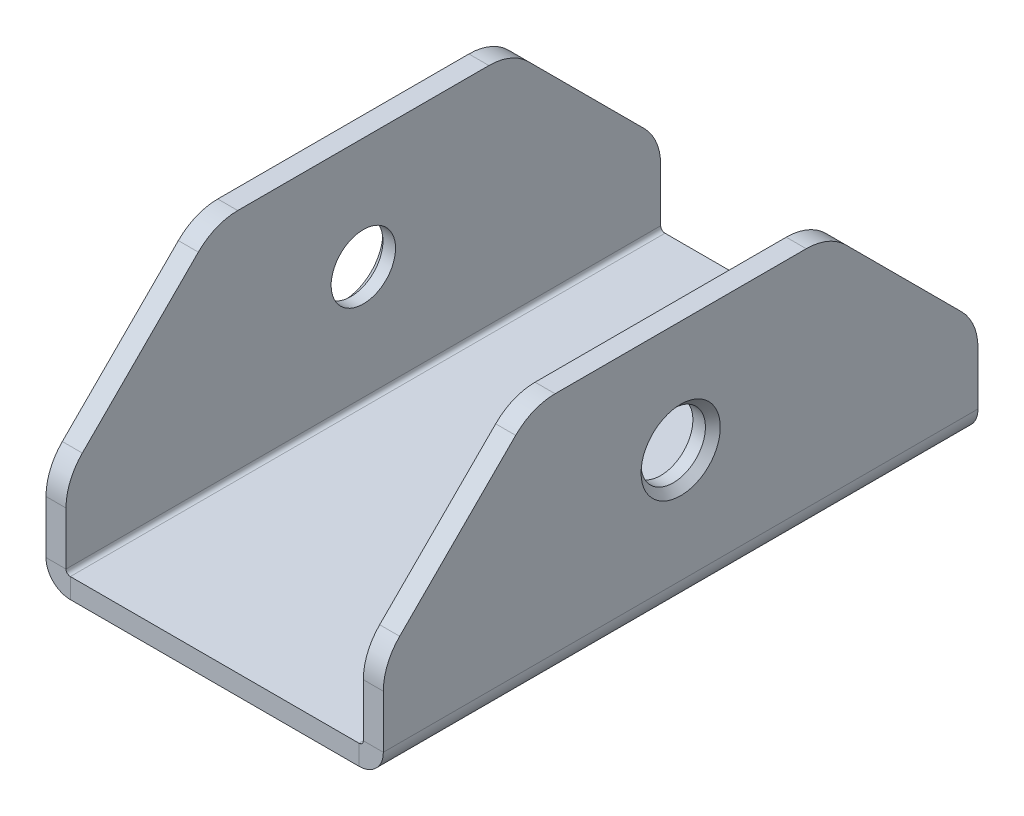
ISO-10303-21;
HEADER;
FILE_DESCRIPTION(('STEP AP214'),'2;1');
FILE_NAME('part.step','',(''),(''),'','','');
FILE_SCHEMA(('AUTOMOTIVE_DESIGN { 1 0 10303 214 1 1 1 1 }'));
ENDSEC;
DATA;
#1=APPLICATION_CONTEXT('core data for automotive mechanical design processes');
#2=APPLICATION_PROTOCOL_DEFINITION('international standard','automotive_design',2000,#1);
#3=PRODUCT_CONTEXT('',#1,'mechanical');
#4=PRODUCT('Part','Part','',(#3));
#5=PRODUCT_RELATED_PRODUCT_CATEGORY('part','',(#4));
#6=PRODUCT_DEFINITION_FORMATION('','',#4);
#7=PRODUCT_DEFINITION_CONTEXT('part definition',#1,'design');
#8=PRODUCT_DEFINITION('design','',#6,#7);
#9=PRODUCT_DEFINITION_SHAPE('','',#8);
#10=(LENGTH_UNIT() NAMED_UNIT(*) SI_UNIT(.MILLI.,.METRE.));
#11=(NAMED_UNIT(*) PLANE_ANGLE_UNIT() SI_UNIT($,.RADIAN.));
#12=(NAMED_UNIT(*) SI_UNIT($,.STERADIAN.) SOLID_ANGLE_UNIT());
#13=UNCERTAINTY_MEASURE_WITH_UNIT(LENGTH_MEASURE(1.E-05),#10,'distance_accuracy_value','');
#14=(GEOMETRIC_REPRESENTATION_CONTEXT(3) GLOBAL_UNCERTAINTY_ASSIGNED_CONTEXT((#13)) GLOBAL_UNIT_ASSIGNED_CONTEXT((#10,
#11,#12)) REPRESENTATION_CONTEXT('',''));
#15=CARTESIAN_POINT('',(0.,0.,0.));
#16=DIRECTION('',(0.,0.,1.));
#17=DIRECTION('',(1.,0.,0.));
#18=AXIS2_PLACEMENT_3D('',#15,#16,#17);
#19=CARTESIAN_POINT('',(0.7366,0.,101.6));
#20=DIRECTION('',(0.,0.,1.));
#21=DIRECTION('',(1.,0.,0.));
#22=AXIS2_PLACEMENT_3D('',#19,#20,#21);
#23=PLANE('',#22);
#24=DIRECTION('',(0.,-1.,0.));
#25=VECTOR('',#24,1.);
#26=CARTESIAN_POINT('',(0.7366,0.,101.6));
#27=LINE('',#26,#25);
#28=CARTESIAN_POINT('',(0.7366,0.,101.6));
#29=VERTEX_POINT('',#28);
#30=CARTESIAN_POINT('',(0.7366,-3.4163,101.6));
#31=VERTEX_POINT('',#30);
#32=EDGE_CURVE('E370',#29,#31,#27,.T.);
#33=ORIENTED_EDGE('',*,*,#32,.F.);
#34=CARTESIAN_POINT('',(0.7366,0.736599999999998,101.6));
#35=DIRECTION('',(0.,0.,-1.));
#36=DIRECTION('',(-1.,0.,0.));
#37=AXIS2_PLACEMENT_3D('',#34,#35,#36);
#38=CIRCLE('',#37,0.7366);
#39=CARTESIAN_POINT('',(0.,0.736599999999997,101.6));
#40=VERTEX_POINT('',#39);
#41=EDGE_CURVE('E252',#40,#29,#38,.F.);
#42=ORIENTED_EDGE('',*,*,#41,.F.);
#43=DIRECTION('',(1.,0.,0.));
#44=VECTOR('',#43,1.);
#45=CARTESIAN_POINT('',(-3.4163,0.736599999999992,101.6));
#46=LINE('',#45,#44);
#47=CARTESIAN_POINT('',(-3.4163,0.736599999999992,101.6));
#48=VERTEX_POINT('',#47);
#49=EDGE_CURVE('E366',#48,#40,#46,.T.);
#50=ORIENTED_EDGE('',*,*,#49,.F.);
#51=CARTESIAN_POINT('',(0.7366,0.736599999999998,101.6));
#52=DIRECTION('',(0.,0.,1.));
#53=DIRECTION('',(1.,0.,0.));
#54=AXIS2_PLACEMENT_3D('',#51,#52,#53);
#55=CIRCLE('',#54,4.1529);
#56=EDGE_CURVE('E265',#48,#31,#55,.T.);
#57=ORIENTED_EDGE('',*,*,#56,.T.);
#58=EDGE_LOOP('',(#33,#42,#50,#57));
#59=FACE_BOUND('',#58,.T.);
#60=ADVANCED_FACE('F43',(#59),#23,.T.);
#61=CARTESIAN_POINT('',(-3.4163,0.736599999999992,101.6));
#62=DIRECTION('',(0.,0.,1.));
#63=DIRECTION('',(1.,0.,0.));
#64=AXIS2_PLACEMENT_3D('',#61,#62,#63);
#65=PLANE('',#64);
#66=DIRECTION('',(1.,0.,0.));
#67=VECTOR('',#66,1.);
#68=CARTESIAN_POINT('',(0.,0.,101.6));
#69=LINE('',#68,#67);
#70=CARTESIAN_POINT('',(50.0634,0.,101.6));
#71=VERTEX_POINT('',#70);
#72=EDGE_CURVE('E249',#29,#71,#69,.T.);
#73=ORIENTED_EDGE('',*,*,#72,.F.);
#74=ORIENTED_EDGE('',*,*,#32,.T.);
#75=DIRECTION('',(1.,0.,0.));
#76=VECTOR('',#75,1.);
#77=CARTESIAN_POINT('',(0.,-3.4163,101.6));
#78=LINE('',#77,#76);
#79=CARTESIAN_POINT('',(50.0634,-3.4163,101.6));
#80=VERTEX_POINT('',#79);
#81=EDGE_CURVE('E269',#31,#80,#78,.T.);
#82=ORIENTED_EDGE('',*,*,#81,.T.);
#83=DIRECTION('',(0.,1.,0.));
#84=VECTOR('',#83,1.);
#85=CARTESIAN_POINT('',(50.0634,-3.4163,101.6));
#86=LINE('',#85,#84);
#87=EDGE_CURVE('E221',#80,#71,#86,.T.);
#88=ORIENTED_EDGE('',*,*,#87,.T.);
#89=EDGE_LOOP('',(#73,#74,#82,#88));
#90=FACE_BOUND('',#89,.T.);
#91=ADVANCED_FACE('F530',(#90),#65,.T.);
#92=CARTESIAN_POINT('',(0.,0.736599999999997,0.));
#93=DIRECTION('',(0.,0.,-1.));
#94=DIRECTION('',(-1.,0.,0.));
#95=AXIS2_PLACEMENT_3D('',#92,#93,#94);
#96=PLANE('',#95);
#97=DIRECTION('',(-1.,0.,0.));
#98=VECTOR('',#97,1.);
#99=CARTESIAN_POINT('',(0.,0.736599999999997,0.));
#100=LINE('',#99,#98);
#101=CARTESIAN_POINT('',(0.,0.736599999999997,0.));
#102=VERTEX_POINT('',#101);
#103=CARTESIAN_POINT('',(-3.4163,0.736599999999992,0.));
#104=VERTEX_POINT('',#103);
#105=EDGE_CURVE('E362',#102,#104,#100,.T.);
#106=ORIENTED_EDGE('',*,*,#105,.F.);
#107=CARTESIAN_POINT('',(0.7366,0.736599999999998,0.));
#108=DIRECTION('',(0.,0.,-1.));
#109=DIRECTION('',(-1.,0.,0.));
#110=AXIS2_PLACEMENT_3D('',#107,#108,#109);
#111=CIRCLE('',#110,0.7366);
#112=CARTESIAN_POINT('',(0.7366,0.,0.));
#113=VERTEX_POINT('',#112);
#114=EDGE_CURVE('E290',#102,#113,#111,.F.);
#115=ORIENTED_EDGE('',*,*,#114,.T.);
#116=DIRECTION('',(0.,1.,0.));
#117=VECTOR('',#116,1.);
#118=CARTESIAN_POINT('',(0.7366,-3.4163,0.));
#119=LINE('',#118,#117);
#120=CARTESIAN_POINT('',(0.7366,-3.4163,0.));
#121=VERTEX_POINT('',#120);
#122=EDGE_CURVE('E220',#121,#113,#119,.T.);
#123=ORIENTED_EDGE('',*,*,#122,.F.);
#124=CARTESIAN_POINT('',(0.7366,0.736599999999998,0.));
#125=DIRECTION('',(0.,0.,1.));
#126=DIRECTION('',(1.,0.,0.));
#127=AXIS2_PLACEMENT_3D('',#124,#125,#126);
#128=CIRCLE('',#127,4.1529);
#129=EDGE_CURVE('E300',#104,#121,#128,.T.);
#130=ORIENTED_EDGE('',*,*,#129,.F.);
#131=EDGE_LOOP('',(#106,#115,#123,#130));
#132=FACE_BOUND('',#131,.T.);
#133=ADVANCED_FACE('F536',(#132),#96,.T.);
#134=CARTESIAN_POINT('',(0.7366,-3.4163,0.));
#135=DIRECTION('',(0.,0.,-1.));
#136=DIRECTION('',(-1.,0.,0.));
#137=AXIS2_PLACEMENT_3D('',#134,#135,#136);
#138=PLANE('',#137);
#139=DIRECTION('',(0.,-1.,0.));
#140=VECTOR('',#139,1.);
#141=CARTESIAN_POINT('',(-3.4163,39.116,0.));
#142=LINE('',#141,#140);
#143=CARTESIAN_POINT('',(-3.4163,9.77061581839628,0.));
#144=VERTEX_POINT('',#143);
#145=EDGE_CURVE('E297',#144,#104,#142,.T.);
#146=ORIENTED_EDGE('',*,*,#145,.F.);
#147=DIRECTION('',(-1.,0.,0.));
#148=VECTOR('',#147,1.);
#149=CARTESIAN_POINT('',(0.7366,9.77061581839628,0.));
#150=LINE('',#149,#148);
#151=CARTESIAN_POINT('',(0.,9.77061581839628,0.));
#152=VERTEX_POINT('',#151);
#153=EDGE_CURVE('E447',#144,#152,#150,.F.);
#154=ORIENTED_EDGE('',*,*,#153,.T.);
#155=DIRECTION('',(0.,-1.,0.));
#156=VECTOR('',#155,1.);
#157=CARTESIAN_POINT('',(0.,39.116,0.));
#158=LINE('',#157,#156);
#159=EDGE_CURVE('E294',#152,#102,#158,.T.);
#160=ORIENTED_EDGE('',*,*,#159,.T.);
#161=ORIENTED_EDGE('',*,*,#105,.T.);
#162=EDGE_LOOP('',(#146,#154,#160,#161));
#163=FACE_BOUND('',#162,.T.);
#164=ADVANCED_FACE('F683',(#163),#138,.T.);
#165=CARTESIAN_POINT('',(50.8,0.7366,101.6));
#166=DIRECTION('',(0.,0.,1.));
#167=DIRECTION('',(1.,0.,0.));
#168=AXIS2_PLACEMENT_3D('',#165,#166,#167);
#169=PLANE('',#168);
#170=DIRECTION('',(1.,0.,0.));
#171=VECTOR('',#170,1.);
#172=CARTESIAN_POINT('',(50.8,0.7366,101.6));
#173=LINE('',#172,#171);
#174=CARTESIAN_POINT('',(50.8,0.7366,101.6));
#175=VERTEX_POINT('',#174);
#176=CARTESIAN_POINT('',(54.2163,0.7366,101.6));
#177=VERTEX_POINT('',#176);
#178=EDGE_CURVE('E207',#175,#177,#173,.T.);
#179=ORIENTED_EDGE('',*,*,#178,.F.);
#180=CARTESIAN_POINT('',(50.0634,0.7366,101.6));
#181=DIRECTION('',(0.,0.,-1.));
#182=DIRECTION('',(-1.,0.,0.));
#183=AXIS2_PLACEMENT_3D('',#180,#181,#182);
#184=CIRCLE('',#183,0.7366);
#185=EDGE_CURVE('E211',#71,#175,#184,.F.);
#186=ORIENTED_EDGE('',*,*,#185,.F.);
#187=ORIENTED_EDGE('',*,*,#87,.F.);
#188=CARTESIAN_POINT('',(50.0634,0.7366,101.6));
#189=DIRECTION('',(0.,0.,1.));
#190=DIRECTION('',(1.,0.,0.));
#191=AXIS2_PLACEMENT_3D('',#188,#189,#190);
#192=CIRCLE('',#191,4.1529);
#193=EDGE_CURVE('E214',#80,#177,#192,.T.);
#194=ORIENTED_EDGE('',*,*,#193,.T.);
#195=EDGE_LOOP('',(#179,#186,#187,#194));
#196=FACE_BOUND('',#195,.T.);
#197=ADVANCED_FACE('F209',(#196),#169,.T.);
#198=CARTESIAN_POINT('',(50.0634,-3.4163,101.6));
#199=DIRECTION('',(0.,0.,1.));
#200=DIRECTION('',(1.,0.,0.));
#201=AXIS2_PLACEMENT_3D('',#198,#199,#200);
#202=PLANE('',#201);
#203=DIRECTION('',(0.,1.,0.));
#204=VECTOR('',#203,1.);
#205=CARTESIAN_POINT('',(54.2163,0.,101.6));
#206=LINE('',#205,#204);
#207=CARTESIAN_POINT('',(54.2163,9.77061581839617,101.6));
#208=VERTEX_POINT('',#207);
#209=EDGE_CURVE('E243',#177,#208,#206,.T.);
#210=ORIENTED_EDGE('',*,*,#209,.T.);
#211=DIRECTION('',(1.,0.,0.));
#212=VECTOR('',#211,1.);
#213=CARTESIAN_POINT('',(50.0634,9.77061581839617,101.6));
#214=LINE('',#213,#212);
#215=CARTESIAN_POINT('',(50.8,9.77061581839617,101.6));
#216=VERTEX_POINT('',#215);
#217=EDGE_CURVE('E241',#208,#216,#214,.F.);
#218=ORIENTED_EDGE('',*,*,#217,.T.);
#219=DIRECTION('',(0.,1.,0.));
#220=VECTOR('',#219,1.);
#221=CARTESIAN_POINT('',(50.8,0.,101.6));
#222=LINE('',#221,#220);
#223=EDGE_CURVE('E228',#175,#216,#222,.T.);
#224=ORIENTED_EDGE('',*,*,#223,.F.);
#225=ORIENTED_EDGE('',*,*,#178,.T.);
#226=EDGE_LOOP('',(#210,#218,#224,#225));
#227=FACE_BOUND('',#226,.T.);
#228=ADVANCED_FACE('F239',(#227),#202,.T.);
#229=CARTESIAN_POINT('',(50.0634,0.,0.));
#230=DIRECTION('',(0.,0.,-1.));
#231=DIRECTION('',(-1.,0.,0.));
#232=AXIS2_PLACEMENT_3D('',#229,#230,#231);
#233=PLANE('',#232);
#234=DIRECTION('',(0.,-1.,0.));
#235=VECTOR('',#234,1.);
#236=CARTESIAN_POINT('',(50.0634,0.,0.));
#237=LINE('',#236,#235);
#238=CARTESIAN_POINT('',(50.0634,0.,0.));
#239=VERTEX_POINT('',#238);
#240=CARTESIAN_POINT('',(50.0634,-3.4163,0.));
#241=VERTEX_POINT('',#240);
#242=EDGE_CURVE('E355',#239,#241,#237,.T.);
#243=ORIENTED_EDGE('',*,*,#242,.F.);
#244=CARTESIAN_POINT('',(50.0634,0.7366,0.));
#245=DIRECTION('',(0.,0.,-1.));
#246=DIRECTION('',(-1.,0.,0.));
#247=AXIS2_PLACEMENT_3D('',#244,#245,#246);
#248=CIRCLE('',#247,0.7366);
#249=CARTESIAN_POINT('',(50.8,0.7366,0.));
#250=VERTEX_POINT('',#249);
#251=EDGE_CURVE('E283',#239,#250,#248,.F.);
#252=ORIENTED_EDGE('',*,*,#251,.T.);
#253=DIRECTION('',(-1.,0.,0.));
#254=VECTOR('',#253,1.);
#255=CARTESIAN_POINT('',(54.2163,0.7366,0.));
#256=LINE('',#255,#254);
#257=CARTESIAN_POINT('',(54.2163,0.7366,0.));
#258=VERTEX_POINT('',#257);
#259=EDGE_CURVE('E352',#258,#250,#256,.T.);
#260=ORIENTED_EDGE('',*,*,#259,.F.);
#261=CARTESIAN_POINT('',(50.0634,0.7366,0.));
#262=DIRECTION('',(0.,0.,1.));
#263=DIRECTION('',(1.,0.,0.));
#264=AXIS2_PLACEMENT_3D('',#261,#262,#263);
#265=CIRCLE('',#264,4.1529);
#266=EDGE_CURVE('E308',#241,#258,#265,.T.);
#267=ORIENTED_EDGE('',*,*,#266,.F.);
#268=EDGE_LOOP('',(#243,#252,#260,#267));
#269=FACE_BOUND('',#268,.T.);
#270=ADVANCED_FACE('F674',(#269),#233,.T.);
#271=CARTESIAN_POINT('',(54.2163,0.7366,0.));
#272=DIRECTION('',(0.,0.,-1.));
#273=DIRECTION('',(-1.,0.,0.));
#274=AXIS2_PLACEMENT_3D('',#271,#272,#273);
#275=PLANE('',#274);
#276=DIRECTION('',(1.,0.,0.));
#277=VECTOR('',#276,1.);
#278=CARTESIAN_POINT('',(0.,0.,0.));
#279=LINE('',#278,#277);
#280=EDGE_CURVE('E286',#113,#239,#279,.T.);
#281=ORIENTED_EDGE('',*,*,#280,.T.);
#282=ORIENTED_EDGE('',*,*,#242,.T.);
#283=DIRECTION('',(1.,0.,0.));
#284=VECTOR('',#283,1.);
#285=CARTESIAN_POINT('',(0.,-3.4163,0.));
#286=LINE('',#285,#284);
#287=EDGE_CURVE('E304',#121,#241,#286,.T.);
#288=ORIENTED_EDGE('',*,*,#287,.F.);
#289=ORIENTED_EDGE('',*,*,#122,.T.);
#290=EDGE_LOOP('',(#281,#282,#288,#289));
#291=FACE_BOUND('',#290,.T.);
#292=ADVANCED_FACE('F670',(#291),#275,.T.);
#293=CARTESIAN_POINT('',(54.2163,0.,101.6));
#294=DIRECTION('',(-1.,0.,0.));
#295=DIRECTION('',(0.,0.,1.));
#296=AXIS2_PLACEMENT_3D('',#293,#294,#295);
#297=PLANE('',#296);
#298=CARTESIAN_POINT('',(54.2163,20.066,50.8));
#299=DIRECTION('',(-1.,0.,0.));
#300=DIRECTION('',(0.,0.,1.));
#301=AXIS2_PLACEMENT_3D('',#298,#299,#300);
#302=CIRCLE('',#301,6.77000000000004);
#303=CARTESIAN_POINT('',(54.2163,20.066,57.57));
#304=VERTEX_POINT('',#303);
#305=EDGE_CURVE('E11',#304,#304,#302,.T.);
#306=ORIENTED_EDGE('',*,*,#305,.T.);
#307=EDGE_LOOP('',(#306));
#308=FACE_BOUND('',#307,.T.);
#309=DIRECTION('',(0.,1.,0.));
#310=VECTOR('',#309,1.);
#311=CARTESIAN_POINT('',(54.2163,0.,0.));
#312=LINE('',#311,#310);
#313=CARTESIAN_POINT('',(54.2163,9.77061581839628,0.));
#314=VERTEX_POINT('',#313);
#315=EDGE_CURVE('E276',#258,#314,#312,.T.);
#316=ORIENTED_EDGE('',*,*,#315,.T.);
#317=CARTESIAN_POINT('',(54.2163,9.77061581839628,9.525));
#318=DIRECTION('',(-1.,0.,0.));
#319=DIRECTION('',(0.,0.,1.));
#320=AXIS2_PLACEMENT_3D('',#317,#318,#319);
#321=CIRCLE('',#320,9.525);
#322=CARTESIAN_POINT('',(54.2163,16.5058079091982,2.78980790919815));
#323=VERTEX_POINT('',#322);
#324=EDGE_CURVE('E464',#314,#323,#321,.F.);
#325=ORIENTED_EDGE('',*,*,#324,.T.);
#326=DIRECTION('',(0.,-0.707106781186546,-0.707106781186549));
#327=VECTOR('',#326,1.);
#328=CARTESIAN_POINT('',(54.2163,13.716,0.));
#329=LINE('',#328,#327);
#330=CARTESIAN_POINT('',(54.2163,36.3261920908019,22.6101920908019));
#331=VERTEX_POINT('',#330);
#332=EDGE_CURVE('E377',#323,#331,#329,.F.);
#333=ORIENTED_EDGE('',*,*,#332,.T.);
#334=CARTESIAN_POINT('',(54.2163,29.591,29.3453841816038));
#335=DIRECTION('',(-1.,0.,0.));
#336=DIRECTION('',(0.,0.,1.));
#337=AXIS2_PLACEMENT_3D('',#334,#335,#336);
#338=CIRCLE('',#337,9.525);
#339=CARTESIAN_POINT('',(54.2163,39.116,29.3453841816038));
#340=VERTEX_POINT('',#339);
#341=EDGE_CURVE('E461',#331,#340,#338,.F.);
#342=ORIENTED_EDGE('',*,*,#341,.T.);
#343=DIRECTION('',(0.,0.,-1.));
#344=VECTOR('',#343,1.);
#345=CARTESIAN_POINT('',(54.2163,39.116,101.6));
#346=LINE('',#345,#344);
#347=CARTESIAN_POINT('',(54.2163,39.116,72.2546158183962));
#348=VERTEX_POINT('',#347);
#349=EDGE_CURVE('E348',#348,#340,#346,.T.);
#350=ORIENTED_EDGE('',*,*,#349,.F.);
#351=CARTESIAN_POINT('',(54.2163,29.591,72.2546158183962));
#352=DIRECTION('',(-1.,0.,0.));
#353=DIRECTION('',(0.,0.,1.));
#354=AXIS2_PLACEMENT_3D('',#351,#352,#353);
#355=CIRCLE('',#354,9.525);
#356=CARTESIAN_POINT('',(54.2163,36.3261920908019,78.9898079091981));
#357=VERTEX_POINT('',#356);
#358=EDGE_CURVE('E458',#348,#357,#355,.F.);
#359=ORIENTED_EDGE('',*,*,#358,.T.);
#360=DIRECTION('',(0.,0.707106781186549,-0.707106781186546));
#361=VECTOR('',#360,1.);
#362=CARTESIAN_POINT('',(54.2163,39.116,76.2));
#363=LINE('',#362,#361);
#364=CARTESIAN_POINT('',(54.2163,16.505807909198,98.8101920908019));
#365=VERTEX_POINT('',#364);
#366=EDGE_CURVE('E373',#357,#365,#363,.F.);
#367=ORIENTED_EDGE('',*,*,#366,.T.);
#368=CARTESIAN_POINT('',(54.2163,9.77061581839617,92.075));
#369=DIRECTION('',(-1.,0.,0.));
#370=DIRECTION('',(0.,0.,1.));
#371=AXIS2_PLACEMENT_3D('',#368,#369,#370);
#372=CIRCLE('',#371,9.525);
#373=EDGE_CURVE('E455',#365,#208,#372,.F.);
#374=ORIENTED_EDGE('',*,*,#373,.T.);
#375=ORIENTED_EDGE('',*,*,#209,.F.);
#376=DIRECTION('',(0.,0.,-1.));
#377=VECTOR('',#376,1.);
#378=CARTESIAN_POINT('',(54.2163,0.7366,101.6));
#379=LINE('',#378,#377);
#380=EDGE_CURVE('E275',#177,#258,#379,.T.);
#381=ORIENTED_EDGE('',*,*,#380,.T.);
#382=EDGE_LOOP('',(#316,#325,#333,#342,#350,#359,#367,#374,#375,#381));
#383=FACE_BOUND('',#382,.T.);
#384=ADVANCED_FACE('F648',(#308,#383),#297,.F.);
#385=CARTESIAN_POINT('',(50.8,39.116,101.6));
#386=DIRECTION('',(0.,1.,0.));
#387=DIRECTION('',(0.,0.,1.));
#388=AXIS2_PLACEMENT_3D('',#385,#386,#387);
#389=PLANE('',#388);
#390=ORIENTED_EDGE('',*,*,#349,.T.);
#391=DIRECTION('',(1.,0.,0.));
#392=VECTOR('',#391,1.);
#393=CARTESIAN_POINT('',(50.8,39.116,29.3453841816038));
#394=LINE('',#393,#392);
#395=CARTESIAN_POINT('',(50.8,39.116,29.3453841816038));
#396=VERTEX_POINT('',#395);
#397=EDGE_CURVE('E488',#340,#396,#394,.F.);
#398=ORIENTED_EDGE('',*,*,#397,.T.);
#399=DIRECTION('',(0.,0.,-1.));
#400=VECTOR('',#399,1.);
#401=CARTESIAN_POINT('',(50.8,39.116,101.6));
#402=LINE('',#401,#400);
#403=CARTESIAN_POINT('',(50.8,39.116,72.2546158183962));
#404=VERTEX_POINT('',#403);
#405=EDGE_CURVE('E235',#404,#396,#402,.T.);
#406=ORIENTED_EDGE('',*,*,#405,.F.);
#407=DIRECTION('',(-1.,0.,0.));
#408=VECTOR('',#407,1.);
#409=CARTESIAN_POINT('',(50.8,39.116,72.2546158183962));
#410=LINE('',#409,#408);
#411=EDGE_CURVE('E484',#404,#348,#410,.F.);
#412=ORIENTED_EDGE('',*,*,#411,.T.);
#413=EDGE_LOOP('',(#390,#398,#406,#412));
#414=FACE_BOUND('',#413,.T.);
#415=ADVANCED_FACE('F657',(#414),#389,.T.);
#416=CARTESIAN_POINT('',(50.8,0.,101.6));
#417=DIRECTION('',(-1.,0.,0.));
#418=DIRECTION('',(0.,0.,1.));
#419=AXIS2_PLACEMENT_3D('',#416,#417,#418);
#420=PLANE('',#419);
#421=CARTESIAN_POINT('',(50.8,20.066,50.8));
#422=DIRECTION('',(-1.,0.,0.));
#423=DIRECTION('',(0.,0.,1.));
#424=AXIS2_PLACEMENT_3D('',#421,#422,#423);
#425=CIRCLE('',#424,5.49999999999998);
#426=CARTESIAN_POINT('',(50.8,20.066,56.3));
#427=VERTEX_POINT('',#426);
#428=EDGE_CURVE('E280',#427,#427,#425,.T.);
#429=ORIENTED_EDGE('',*,*,#428,.F.);
#430=EDGE_LOOP('',(#429));
#431=FACE_BOUND('',#430,.T.);
#432=DIRECTION('',(0.,0.707106781186546,0.707106781186549));
#433=VECTOR('',#432,1.);
#434=CARTESIAN_POINT('',(50.8,57.658,43.9420000000002));
#435=LINE('',#434,#433);
#436=CARTESIAN_POINT('',(50.8,36.3261920908019,22.6101920908019));
#437=VERTEX_POINT('',#436);
#438=CARTESIAN_POINT('',(50.8,16.5058079091982,2.78980790919814));
#439=VERTEX_POINT('',#438);
#440=EDGE_CURVE('E384',#437,#439,#435,.F.);
#441=ORIENTED_EDGE('',*,*,#440,.T.);
#442=CARTESIAN_POINT('',(50.8,9.77061581839628,9.525));
#443=DIRECTION('',(-1.,0.,0.));
#444=DIRECTION('',(0.,0.,1.));
#445=AXIS2_PLACEMENT_3D('',#442,#443,#444);
#446=CIRCLE('',#445,9.525);
#447=CARTESIAN_POINT('',(50.8,9.77061581839628,0.));
#448=VERTEX_POINT('',#447);
#449=EDGE_CURVE('E481',#439,#448,#446,.T.);
#450=ORIENTED_EDGE('',*,*,#449,.T.);
#451=DIRECTION('',(0.,1.,0.));
#452=VECTOR('',#451,1.);
#453=CARTESIAN_POINT('',(50.8,0.,0.));
#454=LINE('',#453,#452);
#455=EDGE_CURVE('E230',#250,#448,#454,.T.);
#456=ORIENTED_EDGE('',*,*,#455,.F.);
#457=DIRECTION('',(0.,0.,-1.));
#458=VECTOR('',#457,1.);
#459=CARTESIAN_POINT('',(50.8,0.7366,101.6));
#460=LINE('',#459,#458);
#461=EDGE_CURVE('E225',#175,#250,#460,.T.);
#462=ORIENTED_EDGE('',*,*,#461,.F.);
#463=ORIENTED_EDGE('',*,*,#223,.T.);
#464=CARTESIAN_POINT('',(50.8,9.77061581839617,92.075));
#465=DIRECTION('',(-1.,0.,0.));
#466=DIRECTION('',(0.,0.,1.));
#467=AXIS2_PLACEMENT_3D('',#464,#465,#466);
#468=CIRCLE('',#467,9.525);
#469=CARTESIAN_POINT('',(50.8,16.505807909198,98.8101920908019));
#470=VERTEX_POINT('',#469);
#471=EDGE_CURVE('E67',#216,#470,#468,.T.);
#472=ORIENTED_EDGE('',*,*,#471,.T.);
#473=DIRECTION('',(0.,-0.707106781186549,0.707106781186546));
#474=VECTOR('',#473,1.);
#475=CARTESIAN_POINT('',(50.8,6.85799999999993,108.458));
#476=LINE('',#475,#474);
#477=CARTESIAN_POINT('',(50.8,36.3261920908019,78.9898079091981));
#478=VERTEX_POINT('',#477);
#479=EDGE_CURVE('E381',#470,#478,#476,.F.);
#480=ORIENTED_EDGE('',*,*,#479,.T.);
#481=CARTESIAN_POINT('',(50.8,29.591,72.2546158183962));
#482=DIRECTION('',(-1.,0.,0.));
#483=DIRECTION('',(0.,0.,1.));
#484=AXIS2_PLACEMENT_3D('',#481,#482,#483);
#485=CIRCLE('',#484,9.525);
#486=EDGE_CURVE('E475',#478,#404,#485,.T.);
#487=ORIENTED_EDGE('',*,*,#486,.T.);
#488=ORIENTED_EDGE('',*,*,#405,.T.);
#489=CARTESIAN_POINT('',(50.8,29.591,29.3453841816038));
#490=DIRECTION('',(-1.,0.,0.));
#491=DIRECTION('',(0.,0.,1.));
#492=AXIS2_PLACEMENT_3D('',#489,#490,#491);
#493=CIRCLE('',#492,9.525);
#494=EDGE_CURVE('E478',#396,#437,#493,.T.);
#495=ORIENTED_EDGE('',*,*,#494,.T.);
#496=EDGE_LOOP('',(#441,#450,#456,#462,#463,#472,#480,#487,#488,#495));
#497=FACE_BOUND('',#496,.T.);
#498=ADVANCED_FACE('F227',(#431,#497),#420,.T.);
#499=CARTESIAN_POINT('',(50.0634,0.7366,101.6));
#500=DIRECTION('',(0.,0.,-1.));
#501=DIRECTION('',(-1.,0.,0.));
#502=AXIS2_PLACEMENT_3D('',#499,#500,#501);
#503=CYLINDRICAL_SURFACE('',#502,0.7366);
#504=ORIENTED_EDGE('',*,*,#251,.F.);
#505=DIRECTION('',(0.,0.,-1.));
#506=VECTOR('',#505,1.);
#507=CARTESIAN_POINT('',(50.0634,0.,101.6));
#508=LINE('',#507,#506);
#509=EDGE_CURVE('E236',#71,#239,#508,.T.);
#510=ORIENTED_EDGE('',*,*,#509,.F.);
#511=ORIENTED_EDGE('',*,*,#185,.T.);
#512=ORIENTED_EDGE('',*,*,#461,.T.);
#513=EDGE_LOOP('',(#504,#510,#511,#512));
#514=FACE_BOUND('',#513,.T.);
#515=ADVANCED_FACE('F246',(#514),#503,.F.);
#516=CARTESIAN_POINT('',(0.,0.,101.6));
#517=DIRECTION('',(0.,1.,0.));
#518=DIRECTION('',(0.,0.,1.));
#519=AXIS2_PLACEMENT_3D('',#516,#517,#518);
#520=PLANE('',#519);
#521=ORIENTED_EDGE('',*,*,#280,.F.);
#522=DIRECTION('',(0.,0.,-1.));
#523=VECTOR('',#522,1.);
#524=CARTESIAN_POINT('',(0.7366,0.,101.6));
#525=LINE('',#524,#523);
#526=EDGE_CURVE('E339',#29,#113,#525,.T.);
#527=ORIENTED_EDGE('',*,*,#526,.F.);
#528=ORIENTED_EDGE('',*,*,#72,.T.);
#529=ORIENTED_EDGE('',*,*,#509,.T.);
#530=EDGE_LOOP('',(#521,#527,#528,#529));
#531=FACE_BOUND('',#530,.T.);
#532=ADVANCED_FACE('F636',(#531),#520,.T.);
#533=CARTESIAN_POINT('',(0.7366,0.736599999999998,101.6));
#534=DIRECTION('',(0.,0.,-1.));
#535=DIRECTION('',(-1.,0.,0.));
#536=AXIS2_PLACEMENT_3D('',#533,#534,#535);
#537=CYLINDRICAL_SURFACE('',#536,0.7366);
#538=ORIENTED_EDGE('',*,*,#114,.F.);
#539=DIRECTION('',(0.,0.,-1.));
#540=VECTOR('',#539,1.);
#541=CARTESIAN_POINT('',(0.,0.736599999999997,101.6));
#542=LINE('',#541,#540);
#543=EDGE_CURVE('E335',#40,#102,#542,.T.);
#544=ORIENTED_EDGE('',*,*,#543,.F.);
#545=ORIENTED_EDGE('',*,*,#41,.T.);
#546=ORIENTED_EDGE('',*,*,#526,.T.);
#547=EDGE_LOOP('',(#538,#544,#545,#546));
#548=FACE_BOUND('',#547,.T.);
#549=ADVANCED_FACE('F628',(#548),#537,.F.);
#550=CARTESIAN_POINT('',(0.,39.116,101.6));
#551=DIRECTION('',(1.,0.,0.));
#552=DIRECTION('',(0.,1.,0.));
#553=AXIS2_PLACEMENT_3D('',#550,#551,#552);
#554=PLANE('',#553);
#555=CARTESIAN_POINT('',(0.,20.066,50.8));
#556=DIRECTION('',(1.,0.,0.));
#557=DIRECTION('',(0.,1.,0.));
#558=AXIS2_PLACEMENT_3D('',#555,#556,#557);
#559=CIRCLE('',#558,5.49999999999998);
#560=CARTESIAN_POINT('',(0.,25.566,50.8));
#561=VERTEX_POINT('',#560);
#562=EDGE_CURVE('E504',#561,#561,#559,.T.);
#563=ORIENTED_EDGE('',*,*,#562,.F.);
#564=EDGE_LOOP('',(#563));
#565=FACE_BOUND('',#564,.T.);
#566=DIRECTION('',(0.,0.,-1.));
#567=VECTOR('',#566,1.);
#568=CARTESIAN_POINT('',(0.,39.116,101.6));
#569=LINE('',#568,#567);
#570=CARTESIAN_POINT('',(0.,39.116,72.2546158183962));
#571=VERTEX_POINT('',#570);
#572=CARTESIAN_POINT('',(0.,39.116,29.3453841816038));
#573=VERTEX_POINT('',#572);
#574=EDGE_CURVE('E331',#571,#573,#569,.T.);
#575=ORIENTED_EDGE('',*,*,#574,.F.);
#576=CARTESIAN_POINT('',(0.,29.591,72.2546158183962));
#577=DIRECTION('',(1.,0.,0.));
#578=DIRECTION('',(0.,1.,0.));
#579=AXIS2_PLACEMENT_3D('',#576,#577,#578);
#580=CIRCLE('',#579,9.525);
#581=CARTESIAN_POINT('',(0.,36.3261920908019,78.9898079091981));
#582=VERTEX_POINT('',#581);
#583=EDGE_CURVE('E420',#571,#582,#580,.T.);
#584=ORIENTED_EDGE('',*,*,#583,.T.);
#585=DIRECTION('',(0.,-0.707106781186549,0.707106781186546));
#586=VECTOR('',#585,1.);
#587=CARTESIAN_POINT('',(0.,26.416,88.8999999999999));
#588=LINE('',#587,#586);
#589=CARTESIAN_POINT('',(0.,16.505807909198,98.8101920908019));
#590=VERTEX_POINT('',#589);
#591=EDGE_CURVE('E387',#582,#590,#588,.T.);
#592=ORIENTED_EDGE('',*,*,#591,.T.);
#593=CARTESIAN_POINT('',(0.,9.77061581839618,92.075));
#594=DIRECTION('',(1.,0.,0.));
#595=DIRECTION('',(0.,1.,0.));
#596=AXIS2_PLACEMENT_3D('',#593,#594,#595);
#597=CIRCLE('',#596,9.525);
#598=CARTESIAN_POINT('',(0.,9.77061581839618,101.6));
#599=VERTEX_POINT('',#598);
#600=EDGE_CURVE('E411',#590,#599,#597,.T.);
#601=ORIENTED_EDGE('',*,*,#600,.T.);
#602=DIRECTION('',(0.,-1.,0.));
#603=VECTOR('',#602,1.);
#604=CARTESIAN_POINT('',(0.,39.116,101.6));
#605=LINE('',#604,#603);
#606=EDGE_CURVE('E259',#599,#40,#605,.T.);
#607=ORIENTED_EDGE('',*,*,#606,.T.);
#608=ORIENTED_EDGE('',*,*,#543,.T.);
#609=ORIENTED_EDGE('',*,*,#159,.F.);
#610=CARTESIAN_POINT('',(0.,9.77061581839628,9.525));
#611=DIRECTION('',(1.,0.,0.));
#612=DIRECTION('',(0.,1.,0.));
#613=AXIS2_PLACEMENT_3D('',#610,#611,#612);
#614=CIRCLE('',#613,9.525);
#615=CARTESIAN_POINT('',(0.,16.5058079091982,2.78980790919813));
#616=VERTEX_POINT('',#615);
#617=EDGE_CURVE('E414',#152,#616,#614,.T.);
#618=ORIENTED_EDGE('',*,*,#617,.T.);
#619=DIRECTION('',(0.,-0.707106781186546,-0.707106781186549));
#620=VECTOR('',#619,1.);
#621=CARTESIAN_POINT('',(0.,77.216,63.5000000000002));
#622=LINE('',#621,#620);
#623=CARTESIAN_POINT('',(0.,36.3261920908019,22.6101920908019));
#624=VERTEX_POINT('',#623);
#625=EDGE_CURVE('E391',#616,#624,#622,.F.);
#626=ORIENTED_EDGE('',*,*,#625,.T.);
#627=CARTESIAN_POINT('',(0.,29.591,29.3453841816038));
#628=DIRECTION('',(1.,0.,0.));
#629=DIRECTION('',(0.,1.,0.));
#630=AXIS2_PLACEMENT_3D('',#627,#628,#629);
#631=CIRCLE('',#630,9.525);
#632=EDGE_CURVE('E417',#624,#573,#631,.T.);
#633=ORIENTED_EDGE('',*,*,#632,.T.);
#634=EDGE_LOOP('',(#575,#584,#592,#601,#607,#608,#609,#618,#626,#633));
#635=FACE_BOUND('',#634,.T.);
#636=ADVANCED_FACE('F617',(#565,#635),#554,.T.);
#637=CARTESIAN_POINT('',(-3.4163,39.116,101.6));
#638=DIRECTION('',(0.,1.,0.));
#639=DIRECTION('',(0.,0.,1.));
#640=AXIS2_PLACEMENT_3D('',#637,#638,#639);
#641=PLANE('',#640);
#642=DIRECTION('',(0.,0.,-1.));
#643=VECTOR('',#642,1.);
#644=CARTESIAN_POINT('',(-3.4163,39.116,101.6));
#645=LINE('',#644,#643);
#646=CARTESIAN_POINT('',(-3.4163,39.116,72.2546158183962));
#647=VERTEX_POINT('',#646);
#648=CARTESIAN_POINT('',(-3.4163,39.116,29.3453841816038));
#649=VERTEX_POINT('',#648);
#650=EDGE_CURVE('E327',#647,#649,#645,.T.);
#651=ORIENTED_EDGE('',*,*,#650,.F.);
#652=DIRECTION('',(1.,0.,0.));
#653=VECTOR('',#652,1.);
#654=CARTESIAN_POINT('',(-3.4163,39.116,72.2546158183962));
#655=LINE('',#654,#653);
#656=EDGE_CURVE('E407',#647,#571,#655,.T.);
#657=ORIENTED_EDGE('',*,*,#656,.T.);
#658=ORIENTED_EDGE('',*,*,#574,.T.);
#659=DIRECTION('',(1.,0.,0.));
#660=VECTOR('',#659,1.);
#661=CARTESIAN_POINT('',(-3.4163,39.116,29.3453841816038));
#662=LINE('',#661,#660);
#663=EDGE_CURVE('E403',#573,#649,#662,.F.);
#664=ORIENTED_EDGE('',*,*,#663,.T.);
#665=EDGE_LOOP('',(#651,#657,#658,#664));
#666=FACE_BOUND('',#665,.T.);
#667=ADVANCED_FACE('F707',(#666),#641,.T.);
#668=CARTESIAN_POINT('',(-3.4163,39.116,101.6));
#669=DIRECTION('',(1.,0.,0.));
#670=DIRECTION('',(0.,1.,0.));
#671=AXIS2_PLACEMENT_3D('',#668,#669,#670);
#672=PLANE('',#671);
#673=CARTESIAN_POINT('',(-3.4163,20.066,50.8));
#674=DIRECTION('',(1.,0.,0.));
#675=DIRECTION('',(0.,1.,0.));
#676=AXIS2_PLACEMENT_3D('',#673,#674,#675);
#677=CIRCLE('',#676,6.77000000000002);
#678=CARTESIAN_POINT('',(-3.4163,26.836,50.8));
#679=VERTEX_POINT('',#678);
#680=EDGE_CURVE('E503',#679,#679,#677,.T.);
#681=ORIENTED_EDGE('',*,*,#680,.T.);
#682=EDGE_LOOP('',(#681));
#683=FACE_BOUND('',#682,.T.);
#684=DIRECTION('',(0.,0.707106781186549,-0.707106781186546));
#685=VECTOR('',#684,1.);
#686=CARTESIAN_POINT('',(-3.4163,39.116,76.2));
#687=LINE('',#686,#685);
#688=CARTESIAN_POINT('',(-3.4163,16.505807909198,98.8101920908019));
#689=VERTEX_POINT('',#688);
#690=CARTESIAN_POINT('',(-3.4163,36.3261920908019,78.9898079091981));
#691=VERTEX_POINT('',#690);
#692=EDGE_CURVE('E395',#689,#691,#687,.T.);
#693=ORIENTED_EDGE('',*,*,#692,.T.);
#694=CARTESIAN_POINT('',(-3.4163,29.591,72.2546158183962));
#695=DIRECTION('',(1.,0.,0.));
#696=DIRECTION('',(0.,1.,0.));
#697=AXIS2_PLACEMENT_3D('',#694,#695,#696);
#698=CIRCLE('',#697,9.525);
#699=EDGE_CURVE('E438',#691,#647,#698,.F.);
#700=ORIENTED_EDGE('',*,*,#699,.T.);
#701=ORIENTED_EDGE('',*,*,#650,.T.);
#702=CARTESIAN_POINT('',(-3.4163,29.591,29.3453841816038));
#703=DIRECTION('',(1.,0.,0.));
#704=DIRECTION('',(0.,1.,0.));
#705=AXIS2_PLACEMENT_3D('',#702,#703,#704);
#706=CIRCLE('',#705,9.525);
#707=CARTESIAN_POINT('',(-3.4163,36.3261920908019,22.6101920908019));
#708=VERTEX_POINT('',#707);
#709=EDGE_CURVE('E435',#649,#708,#706,.F.);
#710=ORIENTED_EDGE('',*,*,#709,.T.);
#711=DIRECTION('',(0.,0.707106781186546,0.707106781186549));
#712=VECTOR('',#711,1.);
#713=CARTESIAN_POINT('',(-3.4163,13.716,0.));
#714=LINE('',#713,#712);
#715=CARTESIAN_POINT('',(-3.4163,16.5058079091982,2.78980790919815));
#716=VERTEX_POINT('',#715);
#717=EDGE_CURVE('E399',#708,#716,#714,.F.);
#718=ORIENTED_EDGE('',*,*,#717,.T.);
#719=CARTESIAN_POINT('',(-3.4163,9.77061581839628,9.525));
#720=DIRECTION('',(1.,0.,0.));
#721=DIRECTION('',(0.,1.,0.));
#722=AXIS2_PLACEMENT_3D('',#719,#720,#721);
#723=CIRCLE('',#722,9.525);
#724=EDGE_CURVE('E432',#716,#144,#723,.F.);
#725=ORIENTED_EDGE('',*,*,#724,.T.);
#726=ORIENTED_EDGE('',*,*,#145,.T.);
#727=DIRECTION('',(0.,0.,-1.));
#728=VECTOR('',#727,1.);
#729=CARTESIAN_POINT('',(-3.4163,0.736599999999992,101.6));
#730=LINE('',#729,#728);
#731=EDGE_CURVE('E323',#48,#104,#730,.T.);
#732=ORIENTED_EDGE('',*,*,#731,.F.);
#733=DIRECTION('',(0.,-1.,0.));
#734=VECTOR('',#733,1.);
#735=CARTESIAN_POINT('',(-3.4163,39.116,101.6));
#736=LINE('',#735,#734);
#737=CARTESIAN_POINT('',(-3.4163,9.77061581839618,101.6));
#738=VERTEX_POINT('',#737);
#739=EDGE_CURVE('E262',#738,#48,#736,.T.);
#740=ORIENTED_EDGE('',*,*,#739,.F.);
#741=CARTESIAN_POINT('',(-3.4163,9.77061581839618,92.075));
#742=DIRECTION('',(1.,0.,0.));
#743=DIRECTION('',(0.,1.,0.));
#744=AXIS2_PLACEMENT_3D('',#741,#742,#743);
#745=CIRCLE('',#744,9.525);
#746=EDGE_CURVE('E429',#738,#689,#745,.F.);
#747=ORIENTED_EDGE('',*,*,#746,.T.);
#748=EDGE_LOOP('',(#693,#700,#701,#710,#718,#725,#726,#732,#740,#747));
#749=FACE_BOUND('',#748,.T.);
#750=ADVANCED_FACE('F697',(#683,#749),#672,.F.);
#751=CARTESIAN_POINT('',(0.7366,0.736599999999998,101.6));
#752=DIRECTION('',(0.,0.,-1.));
#753=DIRECTION('',(-1.,0.,0.));
#754=AXIS2_PLACEMENT_3D('',#751,#752,#753);
#755=CYLINDRICAL_SURFACE('',#754,4.1529);
#756=ORIENTED_EDGE('',*,*,#129,.T.);
#757=DIRECTION('',(0.,0.,-1.));
#758=VECTOR('',#757,1.);
#759=CARTESIAN_POINT('',(0.7366,-3.4163,101.6));
#760=LINE('',#759,#758);
#761=EDGE_CURVE('E319',#31,#121,#760,.T.);
#762=ORIENTED_EDGE('',*,*,#761,.F.);
#763=ORIENTED_EDGE('',*,*,#56,.F.);
#764=ORIENTED_EDGE('',*,*,#731,.T.);
#765=EDGE_LOOP('',(#756,#762,#763,#764));
#766=FACE_BOUND('',#765,.T.);
#767=ADVANCED_FACE('F695',(#766),#755,.T.);
#768=CARTESIAN_POINT('',(0.,-3.4163,101.6));
#769=DIRECTION('',(0.,1.,0.));
#770=DIRECTION('',(0.,0.,1.));
#771=AXIS2_PLACEMENT_3D('',#768,#769,#770);
#772=PLANE('',#771);
#773=ORIENTED_EDGE('',*,*,#287,.T.);
#774=DIRECTION('',(0.,0.,-1.));
#775=VECTOR('',#774,1.);
#776=CARTESIAN_POINT('',(50.0634,-3.4163,101.6));
#777=LINE('',#776,#775);
#778=EDGE_CURVE('E315',#80,#241,#777,.T.);
#779=ORIENTED_EDGE('',*,*,#778,.F.);
#780=ORIENTED_EDGE('',*,*,#81,.F.);
#781=ORIENTED_EDGE('',*,*,#761,.T.);
#782=EDGE_LOOP('',(#773,#779,#780,#781));
#783=FACE_BOUND('',#782,.T.);
#784=ADVANCED_FACE('F640',(#783),#772,.F.);
#785=CARTESIAN_POINT('',(50.0634,0.7366,101.6));
#786=DIRECTION('',(0.,0.,-1.));
#787=DIRECTION('',(-1.,0.,0.));
#788=AXIS2_PLACEMENT_3D('',#785,#786,#787);
#789=CYLINDRICAL_SURFACE('',#788,4.1529);
#790=ORIENTED_EDGE('',*,*,#266,.T.);
#791=ORIENTED_EDGE('',*,*,#380,.F.);
#792=ORIENTED_EDGE('',*,*,#193,.F.);
#793=ORIENTED_EDGE('',*,*,#778,.T.);
#794=EDGE_LOOP('',(#790,#791,#792,#793));
#795=FACE_BOUND('',#794,.T.);
#796=ADVANCED_FACE('F644',(#795),#789,.T.);
#797=CARTESIAN_POINT('',(50.0634,0.7366,101.6));
#798=DIRECTION('',(0.,0.,-1.));
#799=DIRECTION('',(-1.,0.,0.));
#800=AXIS2_PLACEMENT_3D('',#797,#798,#799);
#801=PLANE('',#800);
#802=ORIENTED_EDGE('',*,*,#606,.F.);
#803=DIRECTION('',(-1.,0.,0.));
#804=VECTOR('',#803,1.);
#805=CARTESIAN_POINT('',(-3.4163,9.77061581839618,101.6));
#806=LINE('',#805,#804);
#807=EDGE_CURVE('E499',#599,#738,#806,.T.);
#808=ORIENTED_EDGE('',*,*,#807,.T.);
#809=ORIENTED_EDGE('',*,*,#739,.T.);
#810=ORIENTED_EDGE('',*,*,#49,.T.);
#811=EDGE_LOOP('',(#802,#808,#809,#810));
#812=FACE_BOUND('',#811,.T.);
#813=ADVANCED_FACE('F620',(#812),#801,.F.);
#814=CARTESIAN_POINT('',(50.0634,0.7366,0.));
#815=DIRECTION('',(0.,0.,-1.));
#816=DIRECTION('',(-1.,0.,0.));
#817=AXIS2_PLACEMENT_3D('',#814,#815,#816);
#818=PLANE('',#817);
#819=ORIENTED_EDGE('',*,*,#455,.T.);
#820=DIRECTION('',(-1.,0.,0.));
#821=VECTOR('',#820,1.);
#822=CARTESIAN_POINT('',(50.0634,9.77061581839628,0.));
#823=LINE('',#822,#821);
#824=EDGE_CURVE('E451',#448,#314,#823,.F.);
#825=ORIENTED_EDGE('',*,*,#824,.T.);
#826=ORIENTED_EDGE('',*,*,#315,.F.);
#827=ORIENTED_EDGE('',*,*,#259,.T.);
#828=EDGE_LOOP('',(#819,#825,#826,#827));
#829=FACE_BOUND('',#828,.T.);
#830=ADVANCED_FACE('F549',(#829),#818,.T.);
#831=CARTESIAN_POINT('',(50.0634,13.716,0.));
#832=DIRECTION('',(0.,-0.707106781186549,0.707106781186546));
#833=DIRECTION('',(1.,0.,0.));
#834=AXIS2_PLACEMENT_3D('',#831,#832,#833);
#835=PLANE('',#834);
#836=ORIENTED_EDGE('',*,*,#332,.F.);
#837=DIRECTION('',(1.,0.,0.));
#838=VECTOR('',#837,1.);
#839=CARTESIAN_POINT('',(50.0634,16.5058079091982,2.78980790919815));
#840=LINE('',#839,#838);
#841=EDGE_CURVE('E470',#323,#439,#840,.F.);
#842=ORIENTED_EDGE('',*,*,#841,.T.);
#843=ORIENTED_EDGE('',*,*,#440,.F.);
#844=DIRECTION('',(-1.,0.,0.));
#845=VECTOR('',#844,1.);
#846=CARTESIAN_POINT('',(50.0634,36.3261920908019,22.6101920908019));
#847=LINE('',#846,#845);
#848=EDGE_CURVE('E467',#437,#331,#847,.F.);
#849=ORIENTED_EDGE('',*,*,#848,.T.);
#850=EDGE_LOOP('',(#836,#842,#843,#849));
#851=FACE_BOUND('',#850,.T.);
#852=ADVANCED_FACE('F542',(#851),#835,.F.);
#853=CARTESIAN_POINT('',(50.8,39.116,76.2));
#854=DIRECTION('',(0.,-0.707106781186546,-0.707106781186549));
#855=DIRECTION('',(1.,0.,0.));
#856=AXIS2_PLACEMENT_3D('',#853,#854,#855);
#857=PLANE('',#856);
#858=ORIENTED_EDGE('',*,*,#366,.F.);
#859=DIRECTION('',(1.,0.,0.));
#860=VECTOR('',#859,1.);
#861=CARTESIAN_POINT('',(50.8,36.3261920908019,78.9898079091981));
#862=LINE('',#861,#860);
#863=EDGE_CURVE('E60',#357,#478,#862,.F.);
#864=ORIENTED_EDGE('',*,*,#863,.T.);
#865=ORIENTED_EDGE('',*,*,#479,.F.);
#866=DIRECTION('',(-1.,0.,0.));
#867=VECTOR('',#866,1.);
#868=CARTESIAN_POINT('',(50.8,16.505807909198,98.8101920908019));
#869=LINE('',#868,#867);
#870=EDGE_CURVE('E492',#470,#365,#869,.F.);
#871=ORIENTED_EDGE('',*,*,#870,.T.);
#872=EDGE_LOOP('',(#858,#864,#865,#871));
#873=FACE_BOUND('',#872,.T.);
#874=ADVANCED_FACE('F548',(#873),#857,.F.);
#875=CARTESIAN_POINT('',(0.7366,13.716,0.));
#876=DIRECTION('',(0.,-0.707106781186549,0.707106781186546));
#877=DIRECTION('',(1.,0.,0.));
#878=AXIS2_PLACEMENT_3D('',#875,#876,#877);
#879=PLANE('',#878);
#880=ORIENTED_EDGE('',*,*,#717,.F.);
#881=DIRECTION('',(-1.,0.,0.));
#882=VECTOR('',#881,1.);
#883=CARTESIAN_POINT('',(0.7366,36.3261920908019,22.6101920908019));
#884=LINE('',#883,#882);
#885=EDGE_CURVE('E444',#708,#624,#884,.F.);
#886=ORIENTED_EDGE('',*,*,#885,.T.);
#887=ORIENTED_EDGE('',*,*,#625,.F.);
#888=DIRECTION('',(1.,0.,0.));
#889=VECTOR('',#888,1.);
#890=CARTESIAN_POINT('',(0.7366,16.5058079091982,2.78980790919815));
#891=LINE('',#890,#889);
#892=EDGE_CURVE('E441',#616,#716,#891,.F.);
#893=ORIENTED_EDGE('',*,*,#892,.T.);
#894=EDGE_LOOP('',(#880,#886,#887,#893));
#895=FACE_BOUND('',#894,.T.);
#896=ADVANCED_FACE('F556',(#895),#879,.F.);
#897=CARTESIAN_POINT('',(-3.4163,39.116,76.2));
#898=DIRECTION('',(0.,0.707106781186546,0.707106781186549));
#899=DIRECTION('',(-1.,0.,0.));
#900=AXIS2_PLACEMENT_3D('',#897,#898,#899);
#901=PLANE('',#900);
#902=ORIENTED_EDGE('',*,*,#591,.F.);
#903=DIRECTION('',(1.,0.,0.));
#904=VECTOR('',#903,1.);
#905=CARTESIAN_POINT('',(-3.4163,36.3261920908019,78.9898079091981));
#906=LINE('',#905,#904);
#907=EDGE_CURVE('E426',#582,#691,#906,.F.);
#908=ORIENTED_EDGE('',*,*,#907,.T.);
#909=ORIENTED_EDGE('',*,*,#692,.F.);
#910=DIRECTION('',(-1.,0.,0.));
#911=VECTOR('',#910,1.);
#912=CARTESIAN_POINT('',(0.,16.505807909198,98.8101920908019));
#913=LINE('',#912,#911);
#914=EDGE_CURVE('E423',#689,#590,#913,.F.);
#915=ORIENTED_EDGE('',*,*,#914,.T.);
#916=EDGE_LOOP('',(#902,#908,#909,#915));
#917=FACE_BOUND('',#916,.T.);
#918=ADVANCED_FACE('F562',(#917),#901,.T.);
#919=CARTESIAN_POINT('',(-3.4163,29.591,72.2546158183962));
#920=DIRECTION('',(1.,0.,0.));
#921=DIRECTION('',(0.,0.,-1.));
#922=AXIS2_PLACEMENT_3D('',#919,#920,#921);
#923=CYLINDRICAL_SURFACE('',#922,9.525);
#924=ORIENTED_EDGE('',*,*,#699,.F.);
#925=ORIENTED_EDGE('',*,*,#907,.F.);
#926=ORIENTED_EDGE('',*,*,#583,.F.);
#927=ORIENTED_EDGE('',*,*,#656,.F.);
#928=EDGE_LOOP('',(#924,#925,#926,#927));
#929=FACE_BOUND('',#928,.T.);
#930=ADVANCED_FACE('F569',(#929),#923,.T.);
#931=CARTESIAN_POINT('',(-3.4163,29.591,29.3453841816038));
#932=DIRECTION('',(1.,0.,0.));
#933=DIRECTION('',(0.,0.,-1.));
#934=AXIS2_PLACEMENT_3D('',#931,#932,#933);
#935=CYLINDRICAL_SURFACE('',#934,9.525);
#936=ORIENTED_EDGE('',*,*,#632,.F.);
#937=ORIENTED_EDGE('',*,*,#885,.F.);
#938=ORIENTED_EDGE('',*,*,#709,.F.);
#939=ORIENTED_EDGE('',*,*,#663,.F.);
#940=EDGE_LOOP('',(#936,#937,#938,#939));
#941=FACE_BOUND('',#940,.T.);
#942=ADVANCED_FACE('F573',(#941),#935,.T.);
#943=CARTESIAN_POINT('',(0.7366,9.77061581839628,9.525));
#944=DIRECTION('',(-1.,0.,0.));
#945=DIRECTION('',(0.,0.,1.));
#946=AXIS2_PLACEMENT_3D('',#943,#944,#945);
#947=CYLINDRICAL_SURFACE('',#946,9.525);
#948=ORIENTED_EDGE('',*,*,#724,.F.);
#949=ORIENTED_EDGE('',*,*,#892,.F.);
#950=ORIENTED_EDGE('',*,*,#617,.F.);
#951=ORIENTED_EDGE('',*,*,#153,.F.);
#952=EDGE_LOOP('',(#948,#949,#950,#951));
#953=FACE_BOUND('',#952,.T.);
#954=ADVANCED_FACE('F577',(#953),#947,.T.);
#955=CARTESIAN_POINT('',(50.0634,9.77061581839628,9.525));
#956=DIRECTION('',(-1.,0.,0.));
#957=DIRECTION('',(0.,0.,1.));
#958=AXIS2_PLACEMENT_3D('',#955,#956,#957);
#959=CYLINDRICAL_SURFACE('',#958,9.525);
#960=ORIENTED_EDGE('',*,*,#449,.F.);
#961=ORIENTED_EDGE('',*,*,#841,.F.);
#962=ORIENTED_EDGE('',*,*,#324,.F.);
#963=ORIENTED_EDGE('',*,*,#824,.F.);
#964=EDGE_LOOP('',(#960,#961,#962,#963));
#965=FACE_BOUND('',#964,.T.);
#966=ADVANCED_FACE('F581',(#965),#959,.T.);
#967=CARTESIAN_POINT('',(50.8,29.591,29.3453841816038));
#968=DIRECTION('',(1.,0.,0.));
#969=DIRECTION('',(0.,0.,-1.));
#970=AXIS2_PLACEMENT_3D('',#967,#968,#969);
#971=CYLINDRICAL_SURFACE('',#970,9.525);
#972=ORIENTED_EDGE('',*,*,#341,.F.);
#973=ORIENTED_EDGE('',*,*,#848,.F.);
#974=ORIENTED_EDGE('',*,*,#494,.F.);
#975=ORIENTED_EDGE('',*,*,#397,.F.);
#976=EDGE_LOOP('',(#972,#973,#974,#975));
#977=FACE_BOUND('',#976,.T.);
#978=ADVANCED_FACE('F585',(#977),#971,.T.);
#979=CARTESIAN_POINT('',(50.8,29.591,72.2546158183962));
#980=DIRECTION('',(-1.,0.,0.));
#981=DIRECTION('',(0.,0.,1.));
#982=AXIS2_PLACEMENT_3D('',#979,#980,#981);
#983=CYLINDRICAL_SURFACE('',#982,9.525);
#984=ORIENTED_EDGE('',*,*,#486,.F.);
#985=ORIENTED_EDGE('',*,*,#863,.F.);
#986=ORIENTED_EDGE('',*,*,#358,.F.);
#987=ORIENTED_EDGE('',*,*,#411,.F.);
#988=EDGE_LOOP('',(#984,#985,#986,#987));
#989=FACE_BOUND('',#988,.T.);
#990=ADVANCED_FACE('F589',(#989),#983,.T.);
#991=CARTESIAN_POINT('',(50.0634,9.77061581839617,92.075));
#992=DIRECTION('',(1.,0.,0.));
#993=DIRECTION('',(0.,0.,-1.));
#994=AXIS2_PLACEMENT_3D('',#991,#992,#993);
#995=CYLINDRICAL_SURFACE('',#994,9.525);
#996=ORIENTED_EDGE('',*,*,#373,.F.);
#997=ORIENTED_EDGE('',*,*,#870,.F.);
#998=ORIENTED_EDGE('',*,*,#471,.F.);
#999=ORIENTED_EDGE('',*,*,#217,.F.);
#1000=EDGE_LOOP('',(#996,#997,#998,#999));
#1001=FACE_BOUND('',#1000,.T.);
#1002=ADVANCED_FACE('F593',(#1001),#995,.T.);
#1003=CARTESIAN_POINT('',(50.0634,9.77061581839618,92.075));
#1004=DIRECTION('',(1.,0.,0.));
#1005=DIRECTION('',(0.,0.,-1.));
#1006=AXIS2_PLACEMENT_3D('',#1003,#1004,#1005);
#1007=CYLINDRICAL_SURFACE('',#1006,9.525);
#1008=ORIENTED_EDGE('',*,*,#600,.F.);
#1009=ORIENTED_EDGE('',*,*,#914,.F.);
#1010=ORIENTED_EDGE('',*,*,#746,.F.);
#1011=ORIENTED_EDGE('',*,*,#807,.F.);
#1012=EDGE_LOOP('',(#1008,#1009,#1010,#1011));
#1013=FACE_BOUND('',#1012,.T.);
#1014=ADVANCED_FACE('F597',(#1013),#1007,.T.);
#1015=CARTESIAN_POINT('',(54.2163,20.066,50.8));
#1016=DIRECTION('',(1.,0.,0.));
#1017=DIRECTION('',(0.,0.,-1.));
#1018=AXIS2_PLACEMENT_3D('',#1015,#1016,#1017);
#1019=CYLINDRICAL_SURFACE('',#1018,5.49999999999998);
#1020=CARTESIAN_POINT('',(-2.14629999999997,20.066,50.8));
#1021=DIRECTION('',(1.,0.,0.));
#1022=DIRECTION('',(0.,0.,-1.));
#1023=AXIS2_PLACEMENT_3D('',#1020,#1021,#1022);
#1024=CIRCLE('',#1023,5.49999999999998);
#1025=CARTESIAN_POINT('',(-2.14629999999997,20.066,45.3));
#1026=VERTEX_POINT('',#1025);
#1027=EDGE_CURVE('E511',#1026,#1026,#1024,.F.);
#1028=ORIENTED_EDGE('',*,*,#1027,.T.);
#1029=EDGE_LOOP('',(#1028));
#1030=FACE_BOUND('',#1029,.T.);
#1031=ORIENTED_EDGE('',*,*,#562,.T.);
#1032=EDGE_LOOP('',(#1031));
#1033=FACE_BOUND('',#1032,.T.);
#1034=ADVANCED_FACE('F600',(#1030,#1033),#1019,.F.);
#1035=CARTESIAN_POINT('',(52.9463,20.066,50.8));
#1036=DIRECTION('',(-1.,0.,0.));
#1037=DIRECTION('',(0.,0.,1.));
#1038=AXIS2_PLACEMENT_3D('',#1035,#1036,#1037);
#1039=CIRCLE('',#1038,5.49999999999998);
#1040=CARTESIAN_POINT('',(52.9463,20.066,56.3));
#1041=VERTEX_POINT('',#1040);
#1042=EDGE_CURVE('E53',#1041,#1041,#1039,.F.);
#1043=ORIENTED_EDGE('',*,*,#1042,.T.);
#1044=EDGE_LOOP('',(#1043));
#1045=FACE_BOUND('',#1044,.T.);
#1046=ORIENTED_EDGE('',*,*,#428,.T.);
#1047=EDGE_LOOP('',(#1046));
#1048=FACE_BOUND('',#1047,.T.);
#1049=ADVANCED_FACE('F518',(#1045,#1048),#1019,.F.);
#1050=CARTESIAN_POINT('',(-3.4163,20.066,50.8));
#1051=DIRECTION('',(-1.,0.,0.));
#1052=DIRECTION('',(0.,0.,1.));
#1053=AXIS2_PLACEMENT_3D('',#1050,#1051,#1052);
#1054=CONICAL_SURFACE('',#1053,6.77000000000001,0.785398163397448);
#1055=ORIENTED_EDGE('',*,*,#1027,.F.);
#1056=EDGE_LOOP('',(#1055));
#1057=FACE_BOUND('',#1056,.T.);
#1058=ORIENTED_EDGE('',*,*,#680,.F.);
#1059=EDGE_LOOP('',(#1058));
#1060=FACE_BOUND('',#1059,.T.);
#1061=ADVANCED_FACE('F522',(#1057,#1060),#1054,.F.);
#1062=CARTESIAN_POINT('',(52.9463,20.066,50.8));
#1063=DIRECTION('',(1.,0.,0.));
#1064=DIRECTION('',(0.,0.,-1.));
#1065=AXIS2_PLACEMENT_3D('',#1062,#1063,#1064);
#1066=CONICAL_SURFACE('',#1065,5.49999999999998,0.785398163397459);
#1067=ORIENTED_EDGE('',*,*,#305,.F.);
#1068=EDGE_LOOP('',(#1067));
#1069=FACE_BOUND('',#1068,.T.);
#1070=ORIENTED_EDGE('',*,*,#1042,.F.);
#1071=EDGE_LOOP('',(#1070));
#1072=FACE_BOUND('',#1071,.T.);
#1073=ADVANCED_FACE('F46',(#1069,#1072),#1066,.F.);
#1074=CLOSED_SHELL('',(#60,#91,#133,#164,#197,#228,#270,#292,#384,#415,#498,#515,#532,#549,#636,
#667,#750,#767,#784,#796,#813,#830,#852,#874,#896,#918,#930,#942,#954,#966,#978,#990,#1002,
#1014,#1034,#1049,#1061,#1073));
#1075=MANIFOLD_SOLID_BREP('B2',#1074);
#1076=ADVANCED_BREP_SHAPE_REPRESENTATION('',(#18,#1075),#14);
#1077=SHAPE_DEFINITION_REPRESENTATION(#9,#1076);
ENDSEC;
END-ISO-10303-21;
